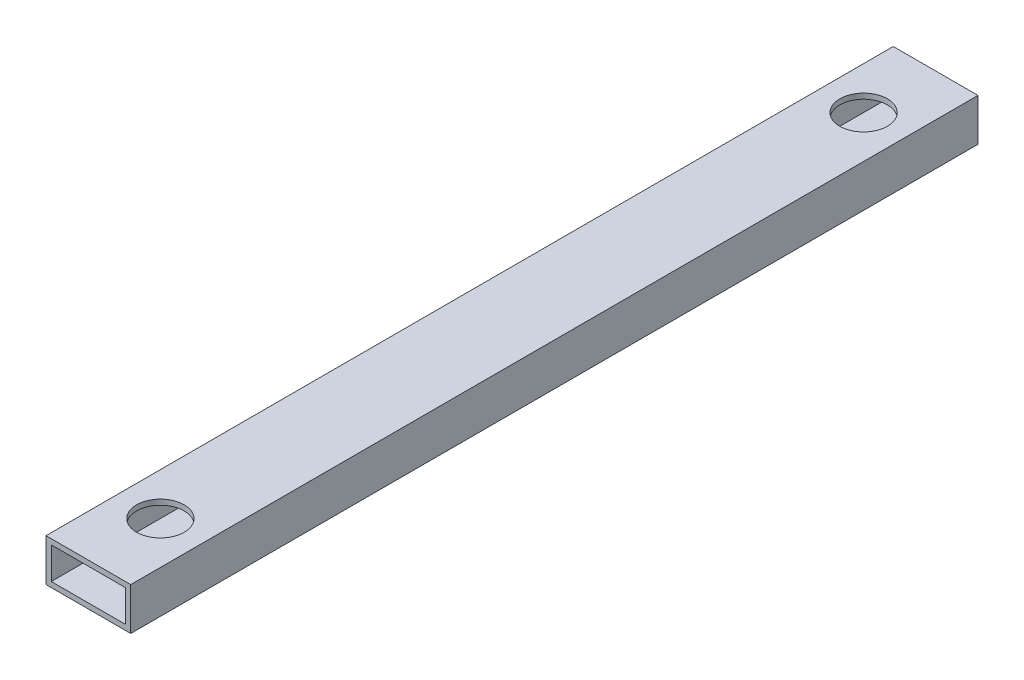
ISO-10303-21;
HEADER;
FILE_DESCRIPTION(('STEP AP214'),'2;1');
FILE_NAME('part.step','',(''),(''),'','','');
FILE_SCHEMA(('AUTOMOTIVE_DESIGN { 1 0 10303 214 1 1 1 1 }'));
ENDSEC;
DATA;
#1=APPLICATION_CONTEXT('core data for automotive mechanical design processes');
#2=APPLICATION_PROTOCOL_DEFINITION('international standard','automotive_design',2000,#1);
#3=PRODUCT_CONTEXT('',#1,'mechanical');
#4=PRODUCT('Part','Part','',(#3));
#5=PRODUCT_RELATED_PRODUCT_CATEGORY('part','',(#4));
#6=PRODUCT_DEFINITION_FORMATION('','',#4);
#7=PRODUCT_DEFINITION_CONTEXT('part definition',#1,'design');
#8=PRODUCT_DEFINITION('design','',#6,#7);
#9=PRODUCT_DEFINITION_SHAPE('','',#8);
#10=(LENGTH_UNIT() NAMED_UNIT(*) SI_UNIT(.MILLI.,.METRE.));
#11=(NAMED_UNIT(*) PLANE_ANGLE_UNIT() SI_UNIT($,.RADIAN.));
#12=(NAMED_UNIT(*) SI_UNIT($,.STERADIAN.) SOLID_ANGLE_UNIT());
#13=UNCERTAINTY_MEASURE_WITH_UNIT(LENGTH_MEASURE(1.E-05),#10,'distance_accuracy_value','');
#14=(GEOMETRIC_REPRESENTATION_CONTEXT(3) GLOBAL_UNCERTAINTY_ASSIGNED_CONTEXT((#13)) GLOBAL_UNIT_ASSIGNED_CONTEXT((#10,
#11,#12)) REPRESENTATION_CONTEXT('',''));
#15=CARTESIAN_POINT('',(0.,0.,0.));
#16=DIRECTION('',(0.,0.,1.));
#17=DIRECTION('',(1.,0.,0.));
#18=AXIS2_PLACEMENT_3D('',#15,#16,#17);
#19=CARTESIAN_POINT('',(0.,0.,508.));
#20=DIRECTION('',(0.,0.,1.));
#21=DIRECTION('',(1.,0.,0.));
#22=AXIS2_PLACEMENT_3D('',#19,#20,#21);
#23=PLANE('',#22);
#24=DIRECTION('',(0.,1.,0.));
#25=VECTOR('',#24,1.);
#26=CARTESIAN_POINT('',(25.4,-12.7,508.));
#27=LINE('',#26,#25);
#28=CARTESIAN_POINT('',(25.4,-12.7,508.));
#29=VERTEX_POINT('',#28);
#30=CARTESIAN_POINT('',(25.4,12.7,508.));
#31=VERTEX_POINT('',#30);
#32=EDGE_CURVE('E162',#29,#31,#27,.T.);
#33=ORIENTED_EDGE('',*,*,#32,.T.);
#34=DIRECTION('',(-1.,0.,0.));
#35=VECTOR('',#34,1.);
#36=CARTESIAN_POINT('',(-25.4,12.7,508.));
#37=LINE('',#36,#35);
#38=CARTESIAN_POINT('',(-25.4,12.7,508.));
#39=VERTEX_POINT('',#38);
#40=EDGE_CURVE('E165',#31,#39,#37,.T.);
#41=ORIENTED_EDGE('',*,*,#40,.T.);
#42=DIRECTION('',(0.,-1.,0.));
#43=VECTOR('',#42,1.);
#44=CARTESIAN_POINT('',(-25.4,-12.7,508.));
#45=LINE('',#44,#43);
#46=CARTESIAN_POINT('',(-25.4,-12.7,508.));
#47=VERTEX_POINT('',#46);
#48=EDGE_CURVE('E168',#39,#47,#45,.T.);
#49=ORIENTED_EDGE('',*,*,#48,.T.);
#50=DIRECTION('',(1.,0.,0.));
#51=VECTOR('',#50,1.);
#52=CARTESIAN_POINT('',(-25.4,-12.7,508.));
#53=LINE('',#52,#51);
#54=EDGE_CURVE('E170',#47,#29,#53,.T.);
#55=ORIENTED_EDGE('',*,*,#54,.T.);
#56=EDGE_LOOP('',(#33,#41,#49,#55));
#57=FACE_BOUND('',#56,.T.);
#58=DIRECTION('',(-1.,0.,0.));
#59=VECTOR('',#58,1.);
#60=CARTESIAN_POINT('',(0.,9.525,508.));
#61=LINE('',#60,#59);
#62=CARTESIAN_POINT('',(22.225,9.525,508.));
#63=VERTEX_POINT('',#62);
#64=CARTESIAN_POINT('',(-22.225,9.525,508.));
#65=VERTEX_POINT('',#64);
#66=EDGE_CURVE('E132',#63,#65,#61,.T.);
#67=ORIENTED_EDGE('',*,*,#66,.F.);
#68=DIRECTION('',(0.,1.,0.));
#69=VECTOR('',#68,1.);
#70=CARTESIAN_POINT('',(22.225,0.,508.));
#71=LINE('',#70,#69);
#72=CARTESIAN_POINT('',(22.225,-9.525,508.));
#73=VERTEX_POINT('',#72);
#74=EDGE_CURVE('E124',#73,#63,#71,.T.);
#75=ORIENTED_EDGE('',*,*,#74,.F.);
#76=DIRECTION('',(1.,0.,0.));
#77=VECTOR('',#76,1.);
#78=CARTESIAN_POINT('',(0.,-9.525,508.));
#79=LINE('',#78,#77);
#80=CARTESIAN_POINT('',(-22.225,-9.525,508.));
#81=VERTEX_POINT('',#80);
#82=EDGE_CURVE('E146',#81,#73,#79,.T.);
#83=ORIENTED_EDGE('',*,*,#82,.F.);
#84=DIRECTION('',(0.,-1.,0.));
#85=VECTOR('',#84,1.);
#86=CARTESIAN_POINT('',(-22.225,0.,508.));
#87=LINE('',#86,#85);
#88=EDGE_CURVE('E144',#65,#81,#87,.T.);
#89=ORIENTED_EDGE('',*,*,#88,.F.);
#90=EDGE_LOOP('',(#67,#75,#83,#89));
#91=FACE_BOUND('',#90,.T.);
#92=ADVANCED_FACE('F57',(#57,#91),#23,.T.);
#93=CARTESIAN_POINT('',(0.,0.,0.));
#94=DIRECTION('',(0.,0.,1.));
#95=DIRECTION('',(1.,0.,0.));
#96=AXIS2_PLACEMENT_3D('',#93,#94,#95);
#97=PLANE('',#96);
#98=DIRECTION('',(0.,1.,0.));
#99=VECTOR('',#98,1.);
#100=CARTESIAN_POINT('',(25.4,-12.7,0.));
#101=LINE('',#100,#99);
#102=CARTESIAN_POINT('',(25.4,-12.7,0.));
#103=VERTEX_POINT('',#102);
#104=CARTESIAN_POINT('',(25.4,12.7,0.));
#105=VERTEX_POINT('',#104);
#106=EDGE_CURVE('E140',#103,#105,#101,.T.);
#107=ORIENTED_EDGE('',*,*,#106,.F.);
#108=DIRECTION('',(1.,0.,0.));
#109=VECTOR('',#108,1.);
#110=CARTESIAN_POINT('',(-25.4,-12.7,0.));
#111=LINE('',#110,#109);
#112=CARTESIAN_POINT('',(-25.4,-12.7,0.));
#113=VERTEX_POINT('',#112);
#114=EDGE_CURVE('E166',#113,#103,#111,.T.);
#115=ORIENTED_EDGE('',*,*,#114,.F.);
#116=DIRECTION('',(0.,-1.,0.));
#117=VECTOR('',#116,1.);
#118=CARTESIAN_POINT('',(-25.4,-12.7,0.));
#119=LINE('',#118,#117);
#120=CARTESIAN_POINT('',(-25.4,12.7,0.));
#121=VERTEX_POINT('',#120);
#122=EDGE_CURVE('E177',#121,#113,#119,.T.);
#123=ORIENTED_EDGE('',*,*,#122,.F.);
#124=DIRECTION('',(-1.,0.,0.));
#125=VECTOR('',#124,1.);
#126=CARTESIAN_POINT('',(-25.4,12.7,0.));
#127=LINE('',#126,#125);
#128=EDGE_CURVE('E175',#105,#121,#127,.T.);
#129=ORIENTED_EDGE('',*,*,#128,.F.);
#130=EDGE_LOOP('',(#107,#115,#123,#129));
#131=FACE_BOUND('',#130,.T.);
#132=DIRECTION('',(0.,1.,0.));
#133=VECTOR('',#132,1.);
#134=CARTESIAN_POINT('',(22.225,0.,0.));
#135=LINE('',#134,#133);
#136=CARTESIAN_POINT('',(22.225,-9.525,0.));
#137=VERTEX_POINT('',#136);
#138=CARTESIAN_POINT('',(22.225,9.525,0.));
#139=VERTEX_POINT('',#138);
#140=EDGE_CURVE('E82',#137,#139,#135,.T.);
#141=ORIENTED_EDGE('',*,*,#140,.T.);
#142=DIRECTION('',(-1.,0.,0.));
#143=VECTOR('',#142,1.);
#144=CARTESIAN_POINT('',(0.,9.525,0.));
#145=LINE('',#144,#143);
#146=CARTESIAN_POINT('',(-22.225,9.525,0.));
#147=VERTEX_POINT('',#146);
#148=EDGE_CURVE('E139',#139,#147,#145,.T.);
#149=ORIENTED_EDGE('',*,*,#148,.T.);
#150=DIRECTION('',(0.,-1.,0.));
#151=VECTOR('',#150,1.);
#152=CARTESIAN_POINT('',(-22.225,0.,0.));
#153=LINE('',#152,#151);
#154=CARTESIAN_POINT('',(-22.225,-9.525,0.));
#155=VERTEX_POINT('',#154);
#156=EDGE_CURVE('E154',#147,#155,#153,.T.);
#157=ORIENTED_EDGE('',*,*,#156,.T.);
#158=DIRECTION('',(1.,0.,0.));
#159=VECTOR('',#158,1.);
#160=CARTESIAN_POINT('',(0.,-9.525,0.));
#161=LINE('',#160,#159);
#162=EDGE_CURVE('E133',#155,#137,#161,.T.);
#163=ORIENTED_EDGE('',*,*,#162,.T.);
#164=EDGE_LOOP('',(#141,#149,#157,#163));
#165=FACE_BOUND('',#164,.T.);
#166=ADVANCED_FACE('F224',(#131,#165),#97,.F.);
#167=CARTESIAN_POINT('',(25.4,-12.7,508.));
#168=DIRECTION('',(-1.,0.,0.));
#169=DIRECTION('',(0.,0.,1.));
#170=AXIS2_PLACEMENT_3D('',#167,#168,#169);
#171=PLANE('',#170);
#172=ORIENTED_EDGE('',*,*,#106,.T.);
#173=DIRECTION('',(0.,0.,-1.));
#174=VECTOR('',#173,1.);
#175=CARTESIAN_POINT('',(25.4,12.7,508.));
#176=LINE('',#175,#174);
#177=EDGE_CURVE('E12',#31,#105,#176,.T.);
#178=ORIENTED_EDGE('',*,*,#177,.F.);
#179=ORIENTED_EDGE('',*,*,#32,.F.);
#180=DIRECTION('',(0.,0.,-1.));
#181=VECTOR('',#180,1.);
#182=CARTESIAN_POINT('',(25.4,-12.7,508.));
#183=LINE('',#182,#181);
#184=EDGE_CURVE('E172',#29,#103,#183,.T.);
#185=ORIENTED_EDGE('',*,*,#184,.T.);
#186=EDGE_LOOP('',(#172,#178,#179,#185));
#187=FACE_BOUND('',#186,.T.);
#188=ADVANCED_FACE('F59',(#187),#171,.F.);
#189=CARTESIAN_POINT('',(-25.4,12.7,508.));
#190=DIRECTION('',(0.,-1.,0.));
#191=DIRECTION('',(0.,0.,-1.));
#192=AXIS2_PLACEMENT_3D('',#189,#190,#191);
#193=PLANE('',#192);
#194=CARTESIAN_POINT('',(0.,12.7,464.82));
#195=DIRECTION('',(0.,1.,0.));
#196=DIRECTION('',(0.,0.,1.));
#197=AXIS2_PLACEMENT_3D('',#194,#195,#196);
#198=CIRCLE('',#197,14.2748);
#199=CARTESIAN_POINT('',(0.,12.7,479.0948));
#200=VERTEX_POINT('',#199);
#201=EDGE_CURVE('E195',#200,#200,#198,.T.);
#202=ORIENTED_EDGE('',*,*,#201,.F.);
#203=EDGE_LOOP('',(#202));
#204=FACE_BOUND('',#203,.T.);
#205=CARTESIAN_POINT('',(0.,12.7,43.18));
#206=DIRECTION('',(0.,1.,0.));
#207=DIRECTION('',(0.,0.,1.));
#208=AXIS2_PLACEMENT_3D('',#205,#206,#207);
#209=CIRCLE('',#208,14.2748);
#210=CARTESIAN_POINT('',(0.,12.7,57.4548));
#211=VERTEX_POINT('',#210);
#212=EDGE_CURVE('E205',#211,#211,#209,.T.);
#213=ORIENTED_EDGE('',*,*,#212,.F.);
#214=EDGE_LOOP('',(#213));
#215=FACE_BOUND('',#214,.T.);
#216=ORIENTED_EDGE('',*,*,#128,.T.);
#217=DIRECTION('',(0.,0.,-1.));
#218=VECTOR('',#217,1.);
#219=CARTESIAN_POINT('',(-25.4,12.7,508.));
#220=LINE('',#219,#218);
#221=EDGE_CURVE('E66',#39,#121,#220,.T.);
#222=ORIENTED_EDGE('',*,*,#221,.F.);
#223=ORIENTED_EDGE('',*,*,#40,.F.);
#224=ORIENTED_EDGE('',*,*,#177,.T.);
#225=EDGE_LOOP('',(#216,#222,#223,#224));
#226=FACE_BOUND('',#225,.T.);
#227=ADVANCED_FACE('F248',(#204,#215,#226),#193,.F.);
#228=CARTESIAN_POINT('',(-25.4,-12.7,508.));
#229=DIRECTION('',(1.,0.,0.));
#230=DIRECTION('',(0.,0.,-1.));
#231=AXIS2_PLACEMENT_3D('',#228,#229,#230);
#232=PLANE('',#231);
#233=ORIENTED_EDGE('',*,*,#122,.T.);
#234=DIRECTION('',(0.,0.,-1.));
#235=VECTOR('',#234,1.);
#236=CARTESIAN_POINT('',(-25.4,-12.7,508.));
#237=LINE('',#236,#235);
#238=EDGE_CURVE('E182',#47,#113,#237,.T.);
#239=ORIENTED_EDGE('',*,*,#238,.F.);
#240=ORIENTED_EDGE('',*,*,#48,.F.);
#241=ORIENTED_EDGE('',*,*,#221,.T.);
#242=EDGE_LOOP('',(#233,#239,#240,#241));
#243=FACE_BOUND('',#242,.T.);
#244=ADVANCED_FACE('F246',(#243),#232,.F.);
#245=CARTESIAN_POINT('',(-25.4,-12.7,508.));
#246=DIRECTION('',(0.,1.,0.));
#247=DIRECTION('',(0.,0.,1.));
#248=AXIS2_PLACEMENT_3D('',#245,#246,#247);
#249=PLANE('',#248);
#250=CARTESIAN_POINT('',(0.,-12.7,464.82));
#251=DIRECTION('',(0.,1.,0.));
#252=DIRECTION('',(0.,0.,1.));
#253=AXIS2_PLACEMENT_3D('',#250,#251,#252);
#254=CIRCLE('',#253,14.2748);
#255=CARTESIAN_POINT('',(0.,-12.7,479.0948));
#256=VERTEX_POINT('',#255);
#257=EDGE_CURVE('E189',#256,#256,#254,.T.);
#258=ORIENTED_EDGE('',*,*,#257,.T.);
#259=EDGE_LOOP('',(#258));
#260=FACE_BOUND('',#259,.T.);
#261=CARTESIAN_POINT('',(0.,-12.7,43.18));
#262=DIRECTION('',(0.,1.,0.));
#263=DIRECTION('',(0.,0.,1.));
#264=AXIS2_PLACEMENT_3D('',#261,#262,#263);
#265=CIRCLE('',#264,14.2748);
#266=CARTESIAN_POINT('',(0.,-12.7,57.4548));
#267=VERTEX_POINT('',#266);
#268=EDGE_CURVE('E200',#267,#267,#265,.T.);
#269=ORIENTED_EDGE('',*,*,#268,.T.);
#270=EDGE_LOOP('',(#269));
#271=FACE_BOUND('',#270,.T.);
#272=ORIENTED_EDGE('',*,*,#114,.T.);
#273=ORIENTED_EDGE('',*,*,#184,.F.);
#274=ORIENTED_EDGE('',*,*,#54,.F.);
#275=ORIENTED_EDGE('',*,*,#238,.T.);
#276=EDGE_LOOP('',(#272,#273,#274,#275));
#277=FACE_BOUND('',#276,.T.);
#278=ADVANCED_FACE('F243',(#260,#271,#277),#249,.F.);
#279=CARTESIAN_POINT('',(22.225,0.,508.));
#280=DIRECTION('',(-1.,0.,0.));
#281=DIRECTION('',(0.,0.,1.));
#282=AXIS2_PLACEMENT_3D('',#279,#280,#281);
#283=PLANE('',#282);
#284=ORIENTED_EDGE('',*,*,#140,.F.);
#285=DIRECTION('',(0.,0.,-1.));
#286=VECTOR('',#285,1.);
#287=CARTESIAN_POINT('',(22.225,-9.525,508.));
#288=LINE('',#287,#286);
#289=EDGE_CURVE('E128',#73,#137,#288,.T.);
#290=ORIENTED_EDGE('',*,*,#289,.F.);
#291=ORIENTED_EDGE('',*,*,#74,.T.);
#292=DIRECTION('',(0.,0.,-1.));
#293=VECTOR('',#292,1.);
#294=CARTESIAN_POINT('',(22.225,9.525,508.));
#295=LINE('',#294,#293);
#296=EDGE_CURVE('E127',#63,#139,#295,.T.);
#297=ORIENTED_EDGE('',*,*,#296,.T.);
#298=EDGE_LOOP('',(#284,#290,#291,#297));
#299=FACE_BOUND('',#298,.T.);
#300=ADVANCED_FACE('F126',(#299),#283,.T.);
#301=CARTESIAN_POINT('',(0.,9.525,508.));
#302=DIRECTION('',(0.,-1.,0.));
#303=DIRECTION('',(0.,0.,-1.));
#304=AXIS2_PLACEMENT_3D('',#301,#302,#303);
#305=PLANE('',#304);
#306=CARTESIAN_POINT('',(0.,9.525,464.82));
#307=DIRECTION('',(0.,-1.,0.));
#308=DIRECTION('',(0.,0.,-1.));
#309=AXIS2_PLACEMENT_3D('',#306,#307,#308);
#310=CIRCLE('',#309,14.2748);
#311=CARTESIAN_POINT('',(0.,9.525,450.5452));
#312=VERTEX_POINT('',#311);
#313=EDGE_CURVE('E152',#312,#312,#310,.T.);
#314=ORIENTED_EDGE('',*,*,#313,.F.);
#315=EDGE_LOOP('',(#314));
#316=FACE_BOUND('',#315,.T.);
#317=CARTESIAN_POINT('',(0.,9.525,43.18));
#318=DIRECTION('',(0.,-1.,0.));
#319=DIRECTION('',(0.,0.,-1.));
#320=AXIS2_PLACEMENT_3D('',#317,#318,#319);
#321=CIRCLE('',#320,14.2748);
#322=CARTESIAN_POINT('',(0.,9.525,28.9052));
#323=VERTEX_POINT('',#322);
#324=EDGE_CURVE('E188',#323,#323,#321,.T.);
#325=ORIENTED_EDGE('',*,*,#324,.F.);
#326=EDGE_LOOP('',(#325));
#327=FACE_BOUND('',#326,.T.);
#328=ORIENTED_EDGE('',*,*,#148,.F.);
#329=ORIENTED_EDGE('',*,*,#296,.F.);
#330=ORIENTED_EDGE('',*,*,#66,.T.);
#331=DIRECTION('',(0.,0.,-1.));
#332=VECTOR('',#331,1.);
#333=CARTESIAN_POINT('',(-22.225,9.525,508.));
#334=LINE('',#333,#332);
#335=EDGE_CURVE('E141',#65,#147,#334,.T.);
#336=ORIENTED_EDGE('',*,*,#335,.T.);
#337=EDGE_LOOP('',(#328,#329,#330,#336));
#338=FACE_BOUND('',#337,.T.);
#339=ADVANCED_FACE('F136',(#316,#327,#338),#305,.T.);
#340=CARTESIAN_POINT('',(-22.225,0.,508.));
#341=DIRECTION('',(1.,0.,0.));
#342=DIRECTION('',(0.,0.,-1.));
#343=AXIS2_PLACEMENT_3D('',#340,#341,#342);
#344=PLANE('',#343);
#345=ORIENTED_EDGE('',*,*,#156,.F.);
#346=ORIENTED_EDGE('',*,*,#335,.F.);
#347=ORIENTED_EDGE('',*,*,#88,.T.);
#348=DIRECTION('',(0.,0.,-1.));
#349=VECTOR('',#348,1.);
#350=CARTESIAN_POINT('',(-22.225,-9.525,508.));
#351=LINE('',#350,#349);
#352=EDGE_CURVE('E74',#81,#155,#351,.T.);
#353=ORIENTED_EDGE('',*,*,#352,.T.);
#354=EDGE_LOOP('',(#345,#346,#347,#353));
#355=FACE_BOUND('',#354,.T.);
#356=ADVANCED_FACE('F220',(#355),#344,.T.);
#357=CARTESIAN_POINT('',(0.,-9.525,508.));
#358=DIRECTION('',(0.,1.,0.));
#359=DIRECTION('',(0.,0.,1.));
#360=AXIS2_PLACEMENT_3D('',#357,#358,#359);
#361=PLANE('',#360);
#362=CARTESIAN_POINT('',(0.,-9.525,464.82));
#363=DIRECTION('',(0.,1.,0.));
#364=DIRECTION('',(0.,0.,1.));
#365=AXIS2_PLACEMENT_3D('',#362,#363,#364);
#366=CIRCLE('',#365,14.2748);
#367=CARTESIAN_POINT('',(0.,-9.525,479.0948));
#368=VERTEX_POINT('',#367);
#369=EDGE_CURVE('E61',#368,#368,#366,.T.);
#370=ORIENTED_EDGE('',*,*,#369,.F.);
#371=EDGE_LOOP('',(#370));
#372=FACE_BOUND('',#371,.T.);
#373=CARTESIAN_POINT('',(0.,-9.525,43.18));
#374=DIRECTION('',(0.,1.,0.));
#375=DIRECTION('',(0.,0.,1.));
#376=AXIS2_PLACEMENT_3D('',#373,#374,#375);
#377=CIRCLE('',#376,14.2748);
#378=CARTESIAN_POINT('',(0.,-9.525,57.4548));
#379=VERTEX_POINT('',#378);
#380=EDGE_CURVE('E186',#379,#379,#377,.T.);
#381=ORIENTED_EDGE('',*,*,#380,.F.);
#382=EDGE_LOOP('',(#381));
#383=FACE_BOUND('',#382,.T.);
#384=ORIENTED_EDGE('',*,*,#162,.F.);
#385=ORIENTED_EDGE('',*,*,#352,.F.);
#386=ORIENTED_EDGE('',*,*,#82,.T.);
#387=ORIENTED_EDGE('',*,*,#289,.T.);
#388=EDGE_LOOP('',(#384,#385,#386,#387));
#389=FACE_BOUND('',#388,.T.);
#390=ADVANCED_FACE('F216',(#372,#383,#389),#361,.T.);
#391=CARTESIAN_POINT('',(0.,-12.7,43.18));
#392=DIRECTION('',(0.,1.,0.));
#393=DIRECTION('',(0.,0.,1.));
#394=AXIS2_PLACEMENT_3D('',#391,#392,#393);
#395=CYLINDRICAL_SURFACE('',#394,14.2748);
#396=ORIENTED_EDGE('',*,*,#380,.T.);
#397=EDGE_LOOP('',(#396));
#398=FACE_BOUND('',#397,.T.);
#399=ORIENTED_EDGE('',*,*,#268,.F.);
#400=EDGE_LOOP('',(#399));
#401=FACE_BOUND('',#400,.T.);
#402=ADVANCED_FACE('F219',(#398,#401),#395,.F.);
#403=CARTESIAN_POINT('',(0.,-12.7,464.82));
#404=DIRECTION('',(0.,1.,0.));
#405=DIRECTION('',(0.,0.,1.));
#406=AXIS2_PLACEMENT_3D('',#403,#404,#405);
#407=CYLINDRICAL_SURFACE('',#406,14.2748);
#408=ORIENTED_EDGE('',*,*,#369,.T.);
#409=EDGE_LOOP('',(#408));
#410=FACE_BOUND('',#409,.T.);
#411=ORIENTED_EDGE('',*,*,#257,.F.);
#412=EDGE_LOOP('',(#411));
#413=FACE_BOUND('',#412,.T.);
#414=ADVANCED_FACE('F213',(#410,#413),#407,.F.);
#415=ORIENTED_EDGE('',*,*,#324,.T.);
#416=EDGE_LOOP('',(#415));
#417=FACE_BOUND('',#416,.T.);
#418=ORIENTED_EDGE('',*,*,#212,.T.);
#419=EDGE_LOOP('',(#418));
#420=FACE_BOUND('',#419,.T.);
#421=ADVANCED_FACE('F272',(#417,#420),#395,.F.);
#422=ORIENTED_EDGE('',*,*,#313,.T.);
#423=EDGE_LOOP('',(#422));
#424=FACE_BOUND('',#423,.T.);
#425=ORIENTED_EDGE('',*,*,#201,.T.);
#426=EDGE_LOOP('',(#425));
#427=FACE_BOUND('',#426,.T.);
#428=ADVANCED_FACE('F274',(#424,#427),#407,.F.);
#429=CLOSED_SHELL('',(#92,#166,#188,#227,#244,#278,#300,#339,#356,#390,#402,#414,#421,#428));
#430=MANIFOLD_SOLID_BREP('B2',#429);
#431=ADVANCED_BREP_SHAPE_REPRESENTATION('',(#18,#430),#14);
#432=SHAPE_DEFINITION_REPRESENTATION(#9,#431);
ENDSEC;
END-ISO-10303-21;
